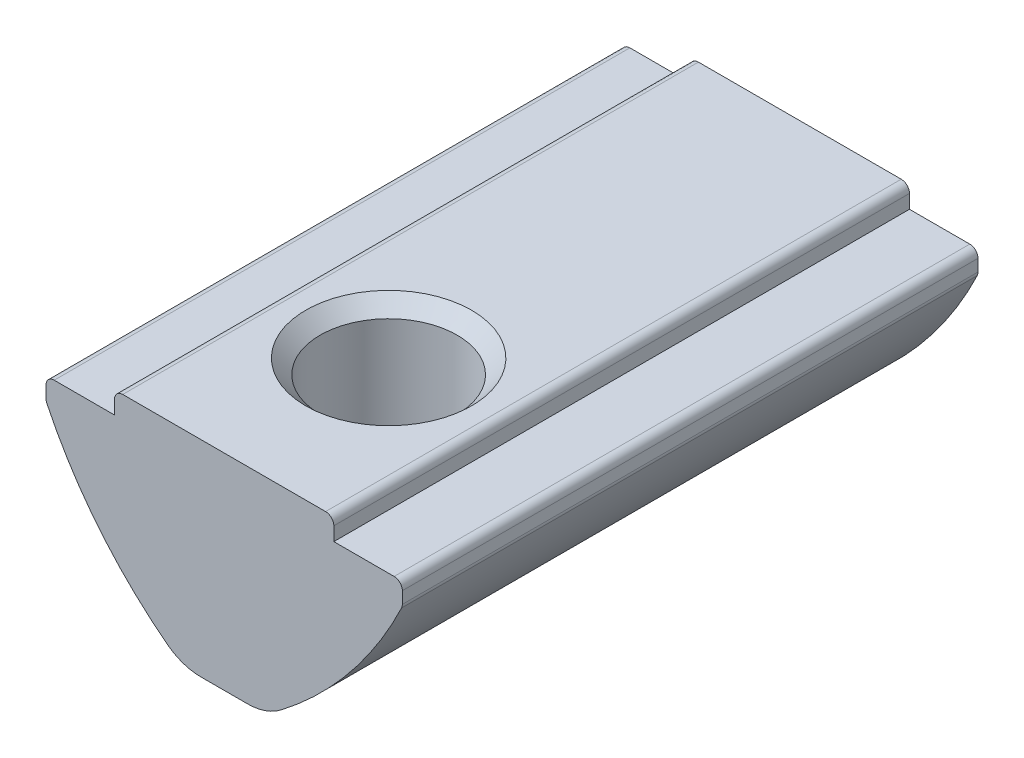
ISO-10303-21;
HEADER;
FILE_DESCRIPTION(('STEP AP214'),'2;1');
FILE_NAME('part.step','',(''),(''),'','','');
FILE_SCHEMA(('AUTOMOTIVE_DESIGN { 1 0 10303 214 1 1 1 1 }'));
ENDSEC;
DATA;
#1=APPLICATION_CONTEXT('core data for automotive mechanical design processes');
#2=APPLICATION_PROTOCOL_DEFINITION('international standard','automotive_design',2000,#1);
#3=PRODUCT_CONTEXT('',#1,'mechanical');
#4=PRODUCT('Part','Part','',(#3));
#5=PRODUCT_RELATED_PRODUCT_CATEGORY('part','',(#4));
#6=PRODUCT_DEFINITION_FORMATION('','',#4);
#7=PRODUCT_DEFINITION_CONTEXT('part definition',#1,'design');
#8=PRODUCT_DEFINITION('design','',#6,#7);
#9=PRODUCT_DEFINITION_SHAPE('','',#8);
#10=(LENGTH_UNIT() NAMED_UNIT(*) SI_UNIT(.MILLI.,.METRE.));
#11=(NAMED_UNIT(*) PLANE_ANGLE_UNIT() SI_UNIT($,.RADIAN.));
#12=(NAMED_UNIT(*) SI_UNIT($,.STERADIAN.) SOLID_ANGLE_UNIT());
#13=UNCERTAINTY_MEASURE_WITH_UNIT(LENGTH_MEASURE(1.E-05),#10,'distance_accuracy_value','');
#14=(GEOMETRIC_REPRESENTATION_CONTEXT(3) GLOBAL_UNCERTAINTY_ASSIGNED_CONTEXT((#13)) GLOBAL_UNIT_ASSIGNED_CONTEXT((#10,
#11,#12)) REPRESENTATION_CONTEXT('',''));
#15=CARTESIAN_POINT('',(0.,0.,0.));
#16=DIRECTION('',(0.,0.,1.));
#17=DIRECTION('',(1.,0.,0.));
#18=AXIS2_PLACEMENT_3D('',#15,#16,#17);
#19=CARTESIAN_POINT('',(-1.5,-7.5,10.5));
#20=DIRECTION('',(0.,1.,0.));
#21=DIRECTION('',(0.,0.,1.));
#22=AXIS2_PLACEMENT_3D('',#19,#20,#21);
#23=PLANE('',#22);
#24=DIRECTION('',(0.,0.,-1.));
#25=VECTOR('',#24,1.);
#26=CARTESIAN_POINT('',(0.84882059675723,-7.5,10.5));
#27=LINE('',#26,#25);
#28=CARTESIAN_POINT('',(0.84882059675723,-7.5,-10.5));
#29=VERTEX_POINT('',#28);
#30=CARTESIAN_POINT('',(0.84882059675723,-7.5,-7.85628300679493));
#31=VERTEX_POINT('',#30);
#32=EDGE_CURVE('E213',#29,#31,#27,.F.);
#33=ORIENTED_EDGE('',*,*,#32,.T.);
#34=CARTESIAN_POINT('',(0.,-7.5,-6.5));
#35=DIRECTION('',(0.,1.,0.));
#36=DIRECTION('',(0.,0.,1.));
#37=AXIS2_PLACEMENT_3D('',#34,#35,#36);
#38=CIRCLE('',#37,1.6);
#39=CARTESIAN_POINT('',(-0.84882059675723,-7.5,-7.85628300679494));
#40=VERTEX_POINT('',#39);
#41=EDGE_CURVE('E58',#31,#40,#38,.T.);
#42=ORIENTED_EDGE('',*,*,#41,.T.);
#43=DIRECTION('',(0.,0.,-1.));
#44=VECTOR('',#43,1.);
#45=CARTESIAN_POINT('',(-0.84882059675723,-7.5,10.5));
#46=LINE('',#45,#44);
#47=CARTESIAN_POINT('',(-0.84882059675723,-7.5,-10.5));
#48=VERTEX_POINT('',#47);
#49=EDGE_CURVE('E379',#40,#48,#46,.T.);
#50=ORIENTED_EDGE('',*,*,#49,.T.);
#51=DIRECTION('',(1.,0.,0.));
#52=VECTOR('',#51,1.);
#53=CARTESIAN_POINT('',(-1.5,-7.5,-10.5));
#54=LINE('',#53,#52);
#55=EDGE_CURVE('E466',#48,#29,#54,.T.);
#56=ORIENTED_EDGE('',*,*,#55,.T.);
#57=EDGE_LOOP('',(#33,#42,#50,#56));
#58=FACE_BOUND('',#57,.T.);
#59=ADVANCED_FACE('F37',(#58),#23,.F.);
#60=CARTESIAN_POINT('',(-0.84882059675723,-7.5,2.14851034564881));
#61=VERTEX_POINT('',#60);
#62=CARTESIAN_POINT('',(-0.84882059675723,-7.5,-5.14371699320506));
#63=VERTEX_POINT('',#62);
#64=EDGE_CURVE('E219',#61,#63,#46,.T.);
#65=ORIENTED_EDGE('',*,*,#64,.T.);
#66=CARTESIAN_POINT('',(0.84882059675723,-7.5,-5.14371699320507));
#67=VERTEX_POINT('',#66);
#68=EDGE_CURVE('E217',#63,#67,#38,.T.);
#69=ORIENTED_EDGE('',*,*,#68,.T.);
#70=CARTESIAN_POINT('',(0.84882059675723,-7.5,2.14851034564881));
#71=VERTEX_POINT('',#70);
#72=EDGE_CURVE('E205',#67,#71,#27,.F.);
#73=ORIENTED_EDGE('',*,*,#72,.T.);
#74=CARTESIAN_POINT('',(0.,-7.5,4.5));
#75=DIRECTION('',(0.,1.,0.));
#76=DIRECTION('',(0.,0.,1.));
#77=AXIS2_PLACEMENT_3D('',#74,#75,#76);
#78=CIRCLE('',#77,2.5);
#79=EDGE_CURVE('E546',#71,#61,#78,.T.);
#80=ORIENTED_EDGE('',*,*,#79,.T.);
#81=EDGE_LOOP('',(#65,#69,#73,#80));
#82=FACE_BOUND('',#81,.T.);
#83=ADVANCED_FACE('F218',(#82),#23,.F.);
#84=CARTESIAN_POINT('',(-0.84882059675723,-5.5,10.5));
#85=DIRECTION('',(0.,0.,-1.));
#86=DIRECTION('',(-1.,0.,0.));
#87=AXIS2_PLACEMENT_3D('',#84,#85,#86);
#88=CYLINDRICAL_SURFACE('',#87,2.);
#89=CARTESIAN_POINT('',(-0.84862059675723,-7.49999999,-5.14359183622355));
#90=CARTESIAN_POINT('',(-0.893920417374782,-7.50001597939785,-5.1719407315319));
#91=CARTESIAN_POINT('',(-0.938411665543847,-7.49847031841211,-5.20157310121503));
#92=CARTESIAN_POINT('',(-1.02536727830624,-7.49266619763591,-5.26346370014139));
#93=CARTESIAN_POINT('',(-1.06783093828147,-7.48840680205097,-5.29572283183958));
#94=CARTESIAN_POINT('',(-1.15058196715608,-7.47754793031724,-5.3631444221097));
#95=CARTESIAN_POINT('',(-1.19085178101182,-7.47093208484472,-5.39832583536386));
#96=CARTESIAN_POINT('',(-1.26841717204776,-7.45588891376005,-5.47143937434215));
#97=CARTESIAN_POINT('',(-1.30571349778757,-7.44746204604972,-5.50937080314435));
#98=CARTESIAN_POINT('',(-1.400673100004,-7.42332855740688,-5.61439144722884));
#99=CARTESIAN_POINT('',(-1.45530041175115,-7.40651913912559,-5.68403319287582));
#100=CARTESIAN_POINT('',(-1.55227512789681,-7.37290832688576,-5.83118215233379));
#101=CARTESIAN_POINT('',(-1.5946663503423,-7.35610712492865,-5.90865992374011));
#102=CARTESIAN_POINT('',(-1.65589549983114,-7.33015326755531,-6.05122785378434));
#103=CARTESIAN_POINT('',(-1.67795236402968,-7.32013387735501,-6.11476472107596));
#104=CARTESIAN_POINT('',(-1.71204388562128,-7.30421907875782,-6.24498489694868));
#105=CARTESIAN_POINT('',(-1.72408787769395,-7.29831983010756,-6.31166521355792));
#106=CARTESIAN_POINT('',(-1.73724099236442,-7.29186203768552,-6.44671795857442));
#107=CARTESIAN_POINT('',(-1.73829597266998,-7.29132993798517,-6.51509710287791));
#108=CARTESIAN_POINT('',(-1.72923200837907,-7.29579993929629,-6.65092865556945));
#109=CARTESIAN_POINT('',(-1.71910897628651,-7.3008040647565,-6.71838071581356));
#110=CARTESIAN_POINT('',(-1.68954026321085,-7.31478083529031,-6.84601911935351));
#111=CARTESIAN_POINT('',(-1.67074609314059,-7.32347318191401,-6.90639235362659));
#112=CARTESIAN_POINT('',(-1.62523242319014,-7.34331257713247,-7.02361961096726));
#113=CARTESIAN_POINT('',(-1.59850827832768,-7.35446106342243,-7.08047154777786));
#114=CARTESIAN_POINT('',(-1.52205364552012,-7.38393190387619,-7.21973230748937));
#115=CARTESIAN_POINT('',(-1.46767727087186,-7.40288997520654,-7.29945773798883));
#116=CARTESIAN_POINT('',(-1.34636969879211,-7.43815652252946,-7.44949920798115));
#117=CARTESIAN_POINT('',(-1.27940762800804,-7.45445829488339,-7.51979136451));
#118=CARTESIAN_POINT('',(-1.15252276724061,-7.47760241382482,-7.63606572297524));
#119=CARTESIAN_POINT('',(-1.09453123398406,-7.48575872197645,-7.6839180532923));
#120=CARTESIAN_POINT('',(-0.974420444333699,-7.49697001250135,-7.77413863930349));
#121=CARTESIAN_POINT('',(-0.912322946277687,-7.50004994530099,-7.81653276756944));
#122=CARTESIAN_POINT('',(-0.84862059675723,-7.49999999,-7.85640816377645));
#123=B_SPLINE_CURVE_WITH_KNOTS('',3,(#89,#90,#91,#92,#93,#94,#95,#96,#97,#98,#99,#100,#101,#102,
#103,#104,#105,#106,#107,#108,#109,#110,#111,#112,#113,#114,#115,#116,#117,#118,#119,#120,#121,
#122),.UNSPECIFIED.,.F.,.F.,(4,2,2,2,2,2,2,2,2,2,2,2,2,2,2,2,4),(0.,0.160266074880731,
0.320587445272625,0.482044950159162,0.643461679794423,0.912696961225031,1.18095578400885,
1.38415001995781,1.5871546113343,1.79115892549288,1.9952378632099,2.18599856740733,
2.37687123099049,2.6703129257304,2.96448407161075,3.19089694141928,3.41619363507759),.UNSPECIFIED.);
#124=EDGE_CURVE('E65',#63,#40,#123,.T.);
#125=ORIENTED_EDGE('',*,*,#124,.F.);
#126=ORIENTED_EDGE('',*,*,#64,.F.);
#127=CARTESIAN_POINT('',(-2.06504804382504,-7.08769984474361,3.09089511508392));
#128=CARTESIAN_POINT('',(-2.02884946522557,-7.11542396513753,3.03787642415071));
#129=CARTESIAN_POINT('',(-1.99056534005318,-7.14278910774625,2.98613210814124));
#130=CARTESIAN_POINT('',(-1.90965497926506,-7.19616959676198,2.88524494045446));
#131=CARTESIAN_POINT('',(-1.86702113813583,-7.22218245456567,2.83610688191055));
#132=CARTESIAN_POINT('',(-1.73158943556605,-7.29762396950776,2.69194448207737));
#133=CARTESIAN_POINT('',(-1.63202667619464,-7.34383579937291,2.60130750250006));
#134=CARTESIAN_POINT('',(-1.44219420001787,-7.41193179500749,2.45531238867026));
#135=CARTESIAN_POINT('',(-1.35553024778449,-7.43699809104728,2.39673013891566));
#136=CARTESIAN_POINT('',(-1.1739706867223,-7.4755471624909,2.29030958967992));
#137=CARTESIAN_POINT('',(-1.07913277437417,-7.48910480787486,2.24240336565446));
#138=CARTESIAN_POINT('',(-0.959553137540056,-7.49705293606094,2.19135820105156));
#139=CARTESIAN_POINT('',(-0.937603755563969,-7.49815114370639,2.18235772006265));
#140=CARTESIAN_POINT('',(-0.893417383983215,-7.4996244611753,2.16496975964218));
#141=CARTESIAN_POINT('',(-0.871180159123296,-7.49999893627301,2.1565828244964));
#142=CARTESIAN_POINT('',(-0.84882059675723,-7.5,2.14851034564881));
#143=B_SPLINE_CURVE_WITH_KNOTS('',3,(#127,#128,#129,#130,#131,#132,#133,#134,#135,#136,#137,
#138,#139,#140,#141,#142),.UNSPECIFIED.,.F.,.F.,(4,2,2,2,2,2,2,4),(0.,0.209670282949377,
0.419713672135732,0.844264308316925,1.16581336286073,1.48525417619118,1.55648665653799,
1.62778158068269),.UNSPECIFIED.);
#144=CARTESIAN_POINT('',(-2.06504804382504,-7.08769984474362,3.09089511508392));
#145=VERTEX_POINT('',#144);
#146=EDGE_CURVE('E285',#145,#61,#143,.T.);
#147=ORIENTED_EDGE('',*,*,#146,.F.);
#148=DIRECTION('',(0.,0.,-1.));
#149=VECTOR('',#148,1.);
#150=CARTESIAN_POINT('',(-2.06504804382504,-7.08769984474362,10.5));
#151=LINE('',#150,#149);
#152=CARTESIAN_POINT('',(-2.06504804382504,-7.08769984474362,-10.5));
#153=VERTEX_POINT('',#152);
#154=EDGE_CURVE('E543',#153,#145,#151,.F.);
#155=ORIENTED_EDGE('',*,*,#154,.F.);
#156=CARTESIAN_POINT('',(-0.84882059675723,-5.5,-10.5));
#157=DIRECTION('',(0.,0.,1.));
#158=DIRECTION('',(1.,0.,0.));
#159=AXIS2_PLACEMENT_3D('',#156,#157,#158);
#160=CIRCLE('',#159,2.);
#161=EDGE_CURVE('E384',#48,#153,#160,.F.);
#162=ORIENTED_EDGE('',*,*,#161,.F.);
#163=ORIENTED_EDGE('',*,*,#49,.F.);
#164=EDGE_LOOP('',(#125,#126,#147,#155,#162,#163));
#165=FACE_BOUND('',#164,.T.);
#166=ADVANCED_FACE('F352',(#165),#88,.T.);
#167=CARTESIAN_POINT('',(0.84882059675723,-5.5,10.5));
#168=DIRECTION('',(0.,0.,-1.));
#169=DIRECTION('',(-1.,0.,0.));
#170=AXIS2_PLACEMENT_3D('',#167,#168,#169);
#171=CYLINDRICAL_SURFACE('',#170,2.);
#172=CARTESIAN_POINT('',(0.84862059675723,-7.49999999,-7.85640816377645));
#173=CARTESIAN_POINT('',(0.893920417374782,-7.50001597939785,-7.8280592684681));
#174=CARTESIAN_POINT('',(0.938411665543847,-7.49847031841211,-7.79842689878497));
#175=CARTESIAN_POINT('',(1.02536727830624,-7.49266619763591,-7.73653629985861));
#176=CARTESIAN_POINT('',(1.06783093828147,-7.48840680205097,-7.70427716816043));
#177=CARTESIAN_POINT('',(1.15058196715608,-7.47754793031724,-7.6368555778903));
#178=CARTESIAN_POINT('',(1.19085178101182,-7.47093208484472,-7.60167416463615));
#179=CARTESIAN_POINT('',(1.26841717204776,-7.45588891376005,-7.52856062565786));
#180=CARTESIAN_POINT('',(1.30571349778757,-7.44746204604972,-7.49062919685565));
#181=CARTESIAN_POINT('',(1.40067310000399,-7.42332855740688,-7.38560855277116));
#182=CARTESIAN_POINT('',(1.45530041175114,-7.40651913912559,-7.31596680712418));
#183=CARTESIAN_POINT('',(1.5522751278968,-7.37290832688577,-7.16881784766621));
#184=CARTESIAN_POINT('',(1.5946663503423,-7.35610712492865,-7.09134007625989));
#185=CARTESIAN_POINT('',(1.65589549983113,-7.33015326755531,-6.94877214621567));
#186=CARTESIAN_POINT('',(1.67795236402968,-7.32013387735502,-6.88523527892405));
#187=CARTESIAN_POINT('',(1.71204388562128,-7.30421907875782,-6.75501510305133));
#188=CARTESIAN_POINT('',(1.72408787769395,-7.29831983010756,-6.68833478644209));
#189=CARTESIAN_POINT('',(1.73724099236442,-7.29186203768552,-6.55328204142559));
#190=CARTESIAN_POINT('',(1.73829597266998,-7.29132993798517,-6.4849028971221));
#191=CARTESIAN_POINT('',(1.72923200837907,-7.29579993929629,-6.34907134443056));
#192=CARTESIAN_POINT('',(1.71910897628651,-7.3008040647565,-6.28161928418645));
#193=CARTESIAN_POINT('',(1.68954026321085,-7.31478083529031,-6.1539808806465));
#194=CARTESIAN_POINT('',(1.67074609314059,-7.32347318191401,-6.09360764637342));
#195=CARTESIAN_POINT('',(1.62523242319015,-7.34331257713247,-5.97638038903274));
#196=CARTESIAN_POINT('',(1.59850827832768,-7.35446106342243,-5.91952845222215));
#197=CARTESIAN_POINT('',(1.52205364552012,-7.38393190387619,-5.78026769251063));
#198=CARTESIAN_POINT('',(1.46767727087186,-7.40288997520653,-5.70054226201118));
#199=CARTESIAN_POINT('',(1.34636969879211,-7.43815652252946,-5.55050079201886));
#200=CARTESIAN_POINT('',(1.27940762800804,-7.45445829488339,-5.48020863549001));
#201=CARTESIAN_POINT('',(1.15252276724061,-7.47760241382482,-5.36393427702477));
#202=CARTESIAN_POINT('',(1.09453123398406,-7.48575872197645,-5.3160819467077));
#203=CARTESIAN_POINT('',(0.9744204443337,-7.49697001250135,-5.22586136069651));
#204=CARTESIAN_POINT('',(0.912322946277686,-7.50004994530099,-5.18346723243056));
#205=CARTESIAN_POINT('',(0.848620596757229,-7.49999999,-5.14359183622355));
#206=B_SPLINE_CURVE_WITH_KNOTS('',3,(#172,#173,#174,#175,#176,#177,#178,#179,#180,#181,#182,
#183,#184,#185,#186,#187,#188,#189,#190,#191,#192,#193,#194,#195,#196,#197,#198,#199,#200,#201,
#202,#203,#204,#205),.UNSPECIFIED.,.F.,.F.,(4,2,2,2,2,2,2,2,2,2,2,2,2,2,2,2,4),(0.,
0.160266074880731,0.320587445272624,0.48204495015916,0.64346167979442,0.912696961225026,
1.18095578400885,1.3841500199578,1.5871546113343,1.79115892549288,1.99523786320989,
2.18599856740732,2.37687123099049,2.67031292573039,2.96448407161075,3.19089694141928,
3.41619363507759),.UNSPECIFIED.);
#207=EDGE_CURVE('E11',#31,#67,#206,.T.);
#208=ORIENTED_EDGE('',*,*,#207,.F.);
#209=ORIENTED_EDGE('',*,*,#32,.F.);
#210=CARTESIAN_POINT('',(0.84882059675723,-5.5,-10.5));
#211=DIRECTION('',(0.,0.,1.));
#212=DIRECTION('',(1.,0.,0.));
#213=AXIS2_PLACEMENT_3D('',#210,#211,#212);
#214=CIRCLE('',#213,2.);
#215=CARTESIAN_POINT('',(2.06504804382504,-7.08769984474362,-10.5));
#216=VERTEX_POINT('',#215);
#217=EDGE_CURVE('E381',#216,#29,#214,.F.);
#218=ORIENTED_EDGE('',*,*,#217,.F.);
#219=DIRECTION('',(0.,0.,-1.));
#220=VECTOR('',#219,1.);
#221=CARTESIAN_POINT('',(2.06504804382504,-7.08769984474362,10.5));
#222=LINE('',#221,#220);
#223=CARTESIAN_POINT('',(2.06504804382505,-7.08769984474361,3.09089511508393));
#224=VERTEX_POINT('',#223);
#225=EDGE_CURVE('E394',#224,#216,#222,.T.);
#226=ORIENTED_EDGE('',*,*,#225,.F.);
#227=CARTESIAN_POINT('',(0.84882059675723,-7.5,2.14851034564881));
#228=CARTESIAN_POINT('',(0.901968749623979,-7.50000933579773,2.1676809833156));
#229=CARTESIAN_POINT('',(0.954425967779777,-7.4978823066011,2.18866656499897));
#230=CARTESIAN_POINT('',(1.05747733761987,-7.4897535051503,2.23397118641904));
#231=CARTESIAN_POINT('',(1.10807429047199,-7.48375783395438,2.25828492997892));
#232=CARTESIAN_POINT('',(1.20669680410747,-7.46834929917004,2.30980409397805));
#233=CARTESIAN_POINT('',(1.25473972584813,-7.4589642127543,2.33698477270637));
#234=CARTESIAN_POINT('',(1.34844165831506,-7.43718734557834,2.3941223163964));
#235=CARTESIAN_POINT('',(1.39409956518012,-7.42479418731004,2.42408044936213));
#236=CARTESIAN_POINT('',(1.54613352594975,-7.37788076511081,2.53104829646633));
#237=CARTESIAN_POINT('',(1.64629156659955,-7.33700041986086,2.61425771112131));
#238=CARTESIAN_POINT('',(1.83044133091475,-7.24557307141553,2.79236940285875));
#239=CARTESIAN_POINT('',(1.91440465564104,-7.19500939143518,2.88729175033324));
#240=CARTESIAN_POINT('',(2.01612819581955,-7.1243114839043,3.02113718611081));
#241=CARTESIAN_POINT('',(2.04105877542152,-7.10607804912092,3.05575043924063));
#242=CARTESIAN_POINT('',(2.06504804382507,-7.08769984474363,3.09089511508391));
#243=B_SPLINE_CURVE_WITH_KNOTS('',3,(#227,#228,#229,#230,#231,#232,#233,#234,#235,#236,#237,
#238,#239,#240,#241,#242),.UNSPECIFIED.,.F.,.F.,(4,2,2,2,2,2,2,4),(0.,0.169376289008547,
0.338486113137806,0.506240367401263,0.674071588001856,1.08112825973564,1.48889237965736,
1.62799674644004),.UNSPECIFIED.);
#244=EDGE_CURVE('E51',#71,#224,#243,.T.);
#245=ORIENTED_EDGE('',*,*,#244,.F.);
#246=ORIENTED_EDGE('',*,*,#72,.F.);
#247=EDGE_LOOP('',(#208,#209,#218,#226,#245,#246));
#248=FACE_BOUND('',#247,.T.);
#249=ADVANCED_FACE('F207',(#248),#171,.T.);
#250=CARTESIAN_POINT('',(4.,0.,10.5));
#251=DIRECTION('',(-1.,0.,0.));
#252=DIRECTION('',(0.,0.,1.));
#253=AXIS2_PLACEMENT_3D('',#250,#251,#252);
#254=PLANE('',#253);
#255=DIRECTION('',(0.,1.,0.));
#256=VECTOR('',#255,1.);
#257=CARTESIAN_POINT('',(4.,0.,-10.5));
#258=LINE('',#257,#256);
#259=CARTESIAN_POINT('',(4.,-0.799999999999998,-10.5));
#260=VERTEX_POINT('',#259);
#261=CARTESIAN_POINT('',(4.,-0.3,-10.5));
#262=VERTEX_POINT('',#261);
#263=EDGE_CURVE('E482',#260,#262,#258,.T.);
#264=ORIENTED_EDGE('',*,*,#263,.T.);
#265=DIRECTION('',(0.,0.,-1.));
#266=VECTOR('',#265,1.);
#267=CARTESIAN_POINT('',(4.,-0.3,10.5));
#268=LINE('',#267,#266);
#269=CARTESIAN_POINT('',(4.,-0.3,10.5));
#270=VERTEX_POINT('',#269);
#271=EDGE_CURVE('E431',#262,#270,#268,.F.);
#272=ORIENTED_EDGE('',*,*,#271,.T.);
#273=DIRECTION('',(0.,1.,0.));
#274=VECTOR('',#273,1.);
#275=CARTESIAN_POINT('',(4.,0.,10.5));
#276=LINE('',#275,#274);
#277=CARTESIAN_POINT('',(4.,-0.799999999999998,10.5));
#278=VERTEX_POINT('',#277);
#279=EDGE_CURVE('E460',#278,#270,#276,.T.);
#280=ORIENTED_EDGE('',*,*,#279,.F.);
#281=DIRECTION('',(0.,0.,-1.));
#282=VECTOR('',#281,1.);
#283=CARTESIAN_POINT('',(4.,-0.799999999999998,10.5));
#284=LINE('',#283,#282);
#285=EDGE_CURVE('E454',#278,#260,#284,.T.);
#286=ORIENTED_EDGE('',*,*,#285,.T.);
#287=EDGE_LOOP('',(#264,#272,#280,#286));
#288=FACE_BOUND('',#287,.T.);
#289=ADVANCED_FACE('F313',(#288),#254,.F.);
#290=CARTESIAN_POINT('',(-4.,0.,10.5));
#291=DIRECTION('',(0.,-1.,0.));
#292=DIRECTION('',(0.,0.,-1.));
#293=AXIS2_PLACEMENT_3D('',#290,#291,#292);
#294=PLANE('',#293);
#295=CARTESIAN_POINT('',(0.,0.,4.5));
#296=DIRECTION('',(0.,1.,0.));
#297=DIRECTION('',(0.,0.,1.));
#298=AXIS2_PLACEMENT_3D('',#295,#296,#297);
#299=CIRCLE('',#298,3.025);
#300=CARTESIAN_POINT('',(0.,0.,7.525));
#301=VERTEX_POINT('',#300);
#302=EDGE_CURVE('E223',#301,#301,#299,.T.);
#303=ORIENTED_EDGE('',*,*,#302,.F.);
#304=EDGE_LOOP('',(#303));
#305=FACE_BOUND('',#304,.T.);
#306=DIRECTION('',(-1.,0.,0.));
#307=VECTOR('',#306,1.);
#308=CARTESIAN_POINT('',(-4.,0.,10.5));
#309=LINE('',#308,#307);
#310=CARTESIAN_POINT('',(3.7,0.,10.5));
#311=VERTEX_POINT('',#310);
#312=CARTESIAN_POINT('',(-3.7,0.,10.5));
#313=VERTEX_POINT('',#312);
#314=EDGE_CURVE('E503',#311,#313,#309,.T.);
#315=ORIENTED_EDGE('',*,*,#314,.F.);
#316=DIRECTION('',(0.,0.,-1.));
#317=VECTOR('',#316,1.);
#318=CARTESIAN_POINT('',(3.7,0.,10.5));
#319=LINE('',#318,#317);
#320=CARTESIAN_POINT('',(3.7,0.,-10.5));
#321=VERTEX_POINT('',#320);
#322=EDGE_CURVE('E446',#311,#321,#319,.T.);
#323=ORIENTED_EDGE('',*,*,#322,.T.);
#324=DIRECTION('',(-1.,0.,0.));
#325=VECTOR('',#324,1.);
#326=CARTESIAN_POINT('',(-4.,0.,-10.5));
#327=LINE('',#326,#325);
#328=CARTESIAN_POINT('',(-3.7,0.,-10.5));
#329=VERTEX_POINT('',#328);
#330=EDGE_CURVE('E479',#321,#329,#327,.T.);
#331=ORIENTED_EDGE('',*,*,#330,.T.);
#332=DIRECTION('',(0.,0.,-1.));
#333=VECTOR('',#332,1.);
#334=CARTESIAN_POINT('',(-3.7,0.,10.5));
#335=LINE('',#334,#333);
#336=EDGE_CURVE('E449',#329,#313,#335,.F.);
#337=ORIENTED_EDGE('',*,*,#336,.T.);
#338=EDGE_LOOP('',(#315,#323,#331,#337));
#339=FACE_BOUND('',#338,.T.);
#340=ADVANCED_FACE('F309',(#305,#339),#294,.F.);
#341=CARTESIAN_POINT('',(-4.,0.,10.5));
#342=DIRECTION('',(1.,0.,0.));
#343=DIRECTION('',(0.,0.,-1.));
#344=AXIS2_PLACEMENT_3D('',#341,#342,#343);
#345=PLANE('',#344);
#346=DIRECTION('',(0.,-1.,0.));
#347=VECTOR('',#346,1.);
#348=CARTESIAN_POINT('',(-4.,0.,10.5));
#349=LINE('',#348,#347);
#350=CARTESIAN_POINT('',(-4.,-0.3,10.5));
#351=VERTEX_POINT('',#350);
#352=CARTESIAN_POINT('',(-4.,-0.8,10.5));
#353=VERTEX_POINT('',#352);
#354=EDGE_CURVE('E501',#351,#353,#349,.T.);
#355=ORIENTED_EDGE('',*,*,#354,.F.);
#356=DIRECTION('',(0.,0.,-1.));
#357=VECTOR('',#356,1.);
#358=CARTESIAN_POINT('',(-4.,-0.3,10.5));
#359=LINE('',#358,#357);
#360=CARTESIAN_POINT('',(-4.,-0.3,-10.5));
#361=VERTEX_POINT('',#360);
#362=EDGE_CURVE('E416',#351,#361,#359,.T.);
#363=ORIENTED_EDGE('',*,*,#362,.T.);
#364=DIRECTION('',(0.,-1.,0.));
#365=VECTOR('',#364,1.);
#366=CARTESIAN_POINT('',(-4.,0.,-10.5));
#367=LINE('',#366,#365);
#368=CARTESIAN_POINT('',(-4.,-0.8,-10.5));
#369=VERTEX_POINT('',#368);
#370=EDGE_CURVE('E477',#361,#369,#367,.T.);
#371=ORIENTED_EDGE('',*,*,#370,.T.);
#372=DIRECTION('',(0.,0.,-1.));
#373=VECTOR('',#372,1.);
#374=CARTESIAN_POINT('',(-4.,-0.8,10.5));
#375=LINE('',#374,#373);
#376=EDGE_CURVE('E451',#353,#369,#375,.T.);
#377=ORIENTED_EDGE('',*,*,#376,.F.);
#378=EDGE_LOOP('',(#355,#363,#371,#377));
#379=FACE_BOUND('',#378,.T.);
#380=ADVANCED_FACE('F305',(#379),#345,.F.);
#381=CARTESIAN_POINT('',(-4.,-0.8,10.5));
#382=DIRECTION('',(0.,-1.,0.));
#383=DIRECTION('',(1.,0.,0.));
#384=AXIS2_PLACEMENT_3D('',#381,#382,#383);
#385=PLANE('',#384);
#386=DIRECTION('',(-1.,0.,0.));
#387=VECTOR('',#386,1.);
#388=CARTESIAN_POINT('',(-4.,-0.8,-10.5));
#389=LINE('',#388,#387);
#390=CARTESIAN_POINT('',(-6.2,-0.8,-10.5));
#391=VERTEX_POINT('',#390);
#392=EDGE_CURVE('E474',#369,#391,#389,.T.);
#393=ORIENTED_EDGE('',*,*,#392,.T.);
#394=DIRECTION('',(0.,0.,-1.));
#395=VECTOR('',#394,1.);
#396=CARTESIAN_POINT('',(-6.2,-0.8,10.5));
#397=LINE('',#396,#395);
#398=CARTESIAN_POINT('',(-6.2,-0.8,10.5));
#399=VERTEX_POINT('',#398);
#400=EDGE_CURVE('E398',#391,#399,#397,.F.);
#401=ORIENTED_EDGE('',*,*,#400,.T.);
#402=DIRECTION('',(-1.,0.,0.));
#403=VECTOR('',#402,1.);
#404=CARTESIAN_POINT('',(-4.,-0.8,10.5));
#405=LINE('',#404,#403);
#406=EDGE_CURVE('E498',#353,#399,#405,.T.);
#407=ORIENTED_EDGE('',*,*,#406,.F.);
#408=ORIENTED_EDGE('',*,*,#376,.T.);
#409=EDGE_LOOP('',(#393,#401,#407,#408));
#410=FACE_BOUND('',#409,.T.);
#411=ADVANCED_FACE('F301',(#410),#385,.F.);
#412=CARTESIAN_POINT('',(-6.5,-0.8,10.5));
#413=DIRECTION('',(1.,0.,0.));
#414=DIRECTION('',(0.,1.,0.));
#415=AXIS2_PLACEMENT_3D('',#412,#413,#414);
#416=PLANE('',#415);
#417=DIRECTION('',(0.,-1.,0.));
#418=VECTOR('',#417,1.);
#419=CARTESIAN_POINT('',(-6.5,-0.8,10.5));
#420=LINE('',#419,#418);
#421=CARTESIAN_POINT('',(-6.5,-1.1,10.5));
#422=VERTEX_POINT('',#421);
#423=CARTESIAN_POINT('',(-6.5,-1.53219657512287,10.5));
#424=VERTEX_POINT('',#423);
#425=EDGE_CURVE('E495',#422,#424,#420,.T.);
#426=ORIENTED_EDGE('',*,*,#425,.F.);
#427=DIRECTION('',(0.,0.,-1.));
#428=VECTOR('',#427,1.);
#429=CARTESIAN_POINT('',(-6.5,-1.1,10.5));
#430=LINE('',#429,#428);
#431=CARTESIAN_POINT('',(-6.5,-1.1,-10.5));
#432=VERTEX_POINT('',#431);
#433=EDGE_CURVE('E400',#422,#432,#430,.T.);
#434=ORIENTED_EDGE('',*,*,#433,.T.);
#435=DIRECTION('',(0.,-1.,0.));
#436=VECTOR('',#435,1.);
#437=CARTESIAN_POINT('',(-6.5,-0.8,-10.5));
#438=LINE('',#437,#436);
#439=CARTESIAN_POINT('',(-6.5,-1.53219657512287,-10.5));
#440=VERTEX_POINT('',#439);
#441=EDGE_CURVE('E471',#432,#440,#438,.T.);
#442=ORIENTED_EDGE('',*,*,#441,.T.);
#443=DIRECTION('',(0.,0.,-1.));
#444=VECTOR('',#443,1.);
#445=CARTESIAN_POINT('',(-6.5,-1.53219657512287,10.5));
#446=LINE('',#445,#444);
#447=EDGE_CURVE('E403',#440,#424,#446,.F.);
#448=ORIENTED_EDGE('',*,*,#447,.T.);
#449=EDGE_LOOP('',(#426,#434,#442,#448));
#450=FACE_BOUND('',#449,.T.);
#451=ADVANCED_FACE('F297',(#450),#416,.F.);
#452=CARTESIAN_POINT('',(7.05665780918356,4.82004899083352,10.5));
#453=DIRECTION('',(0.,0.,-1.));
#454=DIRECTION('',(-1.,0.,0.));
#455=AXIS2_PLACEMENT_3D('',#452,#453,#454);
#456=CYLINDRICAL_SURFACE('',#455,15.);
#457=ORIENTED_EDGE('',*,*,#154,.T.);
#458=CARTESIAN_POINT('',(-2.06504804382504,-7.08769984474362,3.09089511508392));
#459=CARTESIAN_POINT('',(-2.09737445981333,-7.06293749811928,3.13827661478381));
#460=CARTESIAN_POINT('',(-2.12828123600721,-7.03905227258106,3.18706865378425));
#461=CARTESIAN_POINT('',(-2.18702866118469,-6.99331817649837,3.28744119384468));
#462=CARTESIAN_POINT('',(-2.21486652599256,-6.97147115777182,3.33902416467608));
#463=CARTESIAN_POINT('',(-2.29364517288421,-6.90924472930911,3.49837148997924));
#464=CARTESIAN_POINT('',(-2.33948251711551,-6.87246463950198,3.6102012944941));
#465=CARTESIAN_POINT('',(-2.41527572331899,-6.81115469231194,3.84310078308449));
#466=CARTESIAN_POINT('',(-2.44514151637341,-6.78669435421744,3.96421855494102));
#467=CARTESIAN_POINT('',(-2.48640701720856,-6.75279241446028,4.21126368173807));
#468=CARTESIAN_POINT('',(-2.49787255082226,-6.74329727787391,4.33717223496545));
#469=CARTESIAN_POINT('',(-2.50139676601035,-6.74038258044462,4.57640134465964));
#470=CARTESIAN_POINT('',(-2.49533423040156,-6.74540671429955,4.68968151345326));
#471=CARTESIAN_POINT('',(-2.46817666759178,-6.76778211506937,4.91327750289949));
#472=CARTESIAN_POINT('',(-2.44706530264892,-6.78514677940285,5.02358996647682));
#473=CARTESIAN_POINT('',(-2.39173059218085,-6.8302378334115,5.2357985545937));
#474=CARTESIAN_POINT('',(-2.35781294712917,-6.85772229872877,5.33782819942757));
#475=CARTESIAN_POINT('',(-2.27844453052972,-6.92126400435098,5.53436746456581));
#476=CARTESIAN_POINT('',(-2.23299917771901,-6.95731721631338,5.62888059075725));
#477=CARTESIAN_POINT('',(-2.16428092016536,-7.01104706106402,5.75192225411085));
#478=CARTESIAN_POINT('',(-2.14527307167119,-7.025839950066,5.78421074532453));
#479=CARTESIAN_POINT('',(-2.10605445779357,-7.05620113833132,5.84755943024061));
#480=CARTESIAN_POINT('',(-2.08584643337487,-7.07176765842885,5.87862217207367));
#481=CARTESIAN_POINT('',(-2.06504804382525,-7.08769984474351,5.90910488491625));
#482=B_SPLINE_CURVE_WITH_KNOTS('',3,(#458,#459,#460,#461,#462,#463,#464,#465,#466,#467,#468,
#469,#470,#471,#472,#473,#474,#475,#476,#477,#478,#479,#480,#481),.UNSPECIFIED.,.F.,.F.,(4,2,2,
2,2,2,2,2,2,2,2,4),(0.,0.187352740943834,0.374874076953904,0.752018020771248,1.1312669577879,
1.50915610536268,1.8480890831049,2.18739058450256,2.5190579642195,2.85056972769057,
2.97138643388061,3.09193710389708),.UNSPECIFIED.);
#483=CARTESIAN_POINT('',(-2.06504804382504,-7.08769984474361,5.90910488491608));
#484=VERTEX_POINT('',#483);
#485=EDGE_CURVE('E278',#145,#484,#482,.T.);
#486=ORIENTED_EDGE('',*,*,#485,.T.);
#487=CARTESIAN_POINT('',(-2.06504804382504,-7.08769984474362,10.5));
#488=VERTEX_POINT('',#487);
#489=EDGE_CURVE('E538',#484,#488,#151,.F.);
#490=ORIENTED_EDGE('',*,*,#489,.T.);
#491=CARTESIAN_POINT('',(7.05665780918356,4.82004899083352,10.5));
#492=DIRECTION('',(0.,0.,1.));
#493=DIRECTION('',(1.,0.,0.));
#494=AXIS2_PLACEMENT_3D('',#491,#492,#493);
#495=CIRCLE('',#494,15.);
#496=CARTESIAN_POINT('',(-6.47054403692211,-1.66183423973423,10.5));
#497=VERTEX_POINT('',#496);
#498=EDGE_CURVE('E492',#497,#488,#495,.T.);
#499=ORIENTED_EDGE('',*,*,#498,.F.);
#500=DIRECTION('',(0.,0.,-1.));
#501=VECTOR('',#500,1.);
#502=CARTESIAN_POINT('',(-6.47054403692211,-1.66183423973423,10.5));
#503=LINE('',#502,#501);
#504=CARTESIAN_POINT('',(-6.47054403692211,-1.66183423973423,-10.5));
#505=VERTEX_POINT('',#504);
#506=EDGE_CURVE('E395',#497,#505,#503,.T.);
#507=ORIENTED_EDGE('',*,*,#506,.T.);
#508=CARTESIAN_POINT('',(7.05665780918356,4.82004899083352,-10.5));
#509=DIRECTION('',(0.,0.,1.));
#510=DIRECTION('',(1.,0.,0.));
#511=AXIS2_PLACEMENT_3D('',#508,#509,#510);
#512=CIRCLE('',#511,15.);
#513=EDGE_CURVE('E468',#505,#153,#512,.T.);
#514=ORIENTED_EDGE('',*,*,#513,.T.);
#515=EDGE_LOOP('',(#457,#486,#490,#499,#507,#514));
#516=FACE_BOUND('',#515,.T.);
#517=ADVANCED_FACE('F291',(#516),#456,.T.);
#518=CARTESIAN_POINT('',(-0.84882059675723,-7.5,10.5));
#519=VERTEX_POINT('',#518);
#520=CARTESIAN_POINT('',(-0.84882059675723,-7.5,6.85148965435119));
#521=VERTEX_POINT('',#520);
#522=EDGE_CURVE('E371',#519,#521,#46,.T.);
#523=ORIENTED_EDGE('',*,*,#522,.T.);
#524=CARTESIAN_POINT('',(0.84882059675723,-7.5,6.85148965435119));
#525=VERTEX_POINT('',#524);
#526=EDGE_CURVE('E372',#521,#525,#78,.T.);
#527=ORIENTED_EDGE('',*,*,#526,.T.);
#528=CARTESIAN_POINT('',(0.84882059675723,-7.5,10.5));
#529=VERTEX_POINT('',#528);
#530=EDGE_CURVE('E214',#525,#529,#27,.F.);
#531=ORIENTED_EDGE('',*,*,#530,.T.);
#532=DIRECTION('',(1.,0.,0.));
#533=VECTOR('',#532,1.);
#534=CARTESIAN_POINT('',(-1.5,-7.5,10.5));
#535=LINE('',#534,#533);
#536=EDGE_CURVE('E375',#519,#529,#535,.T.);
#537=ORIENTED_EDGE('',*,*,#536,.F.);
#538=EDGE_LOOP('',(#523,#527,#531,#537));
#539=FACE_BOUND('',#538,.T.);
#540=ADVANCED_FACE('F296',(#539),#23,.F.);
#541=CARTESIAN_POINT('',(-7.05665780918356,4.82004899083352,10.5));
#542=DIRECTION('',(0.,0.,-1.));
#543=DIRECTION('',(-1.,0.,0.));
#544=AXIS2_PLACEMENT_3D('',#541,#542,#543);
#545=CYLINDRICAL_SURFACE('',#544,15.);
#546=CARTESIAN_POINT('',(2.06504804382504,-7.08769984474362,10.5));
#547=VERTEX_POINT('',#546);
#548=CARTESIAN_POINT('',(2.06504804382504,-7.08769984474362,5.90910488491608));
#549=VERTEX_POINT('',#548);
#550=EDGE_CURVE('E389',#547,#549,#222,.T.);
#551=ORIENTED_EDGE('',*,*,#550,.T.);
#552=CARTESIAN_POINT('',(2.06504804382505,-7.08769984474361,5.90910488491607));
#553=CARTESIAN_POINT('',(2.09737445981334,-7.06293749811928,5.86172338521618));
#554=CARTESIAN_POINT('',(2.12828123600722,-7.03905227258105,5.81293134621575));
#555=CARTESIAN_POINT('',(2.18702866118469,-6.99331817649837,5.71255880615531));
#556=CARTESIAN_POINT('',(2.21486652599257,-6.97147115777182,5.66097583532391));
#557=CARTESIAN_POINT('',(2.29364517288422,-6.90924472930911,5.50162851002075));
#558=CARTESIAN_POINT('',(2.33948251711551,-6.87246463950198,5.38979870550589));
#559=CARTESIAN_POINT('',(2.415275723319,-6.81115469231194,5.1568992169155));
#560=CARTESIAN_POINT('',(2.44514151637341,-6.78669435421744,5.03578144505897));
#561=CARTESIAN_POINT('',(2.48640701720856,-6.75279241446028,4.78873631826193));
#562=CARTESIAN_POINT('',(2.49787255082226,-6.74329727787391,4.66282776503454));
#563=CARTESIAN_POINT('',(2.50139676601035,-6.74038258044462,4.42359865534035));
#564=CARTESIAN_POINT('',(2.49533423040156,-6.74540671429955,4.31031848654673));
#565=CARTESIAN_POINT('',(2.46817666759178,-6.76778211506938,4.0867224971005));
#566=CARTESIAN_POINT('',(2.44706530264892,-6.78514677940286,3.97641003352318));
#567=CARTESIAN_POINT('',(2.39173059218085,-6.8302378334115,3.76420144540629));
#568=CARTESIAN_POINT('',(2.35781294712916,-6.85772229872877,3.66217180057242));
#569=CARTESIAN_POINT('',(2.27844453052972,-6.92126400435098,3.46563253543418));
#570=CARTESIAN_POINT('',(2.23299917771901,-6.95731721631339,3.37111940924274));
#571=CARTESIAN_POINT('',(2.16428092016536,-7.01104706106403,3.24807774588915));
#572=CARTESIAN_POINT('',(2.14527307167119,-7.025839950066,3.21578925467547));
#573=CARTESIAN_POINT('',(2.10605445779357,-7.05620113833132,3.15244056975939));
#574=CARTESIAN_POINT('',(2.08584643337487,-7.07176765842885,3.12137782792634));
#575=CARTESIAN_POINT('',(2.06504804382526,-7.08769984474351,3.09089511508376));
#576=B_SPLINE_CURVE_WITH_KNOTS('',3,(#552,#553,#554,#555,#556,#557,#558,#559,#560,#561,#562,
#563,#564,#565,#566,#567,#568,#569,#570,#571,#572,#573,#574,#575),.UNSPECIFIED.,.F.,.F.,(4,2,2,
2,2,2,2,2,2,2,2,4),(0.,0.187352740943833,0.374874076953902,0.752018020771246,1.13126695778789,
1.50915610536268,1.8480890831049,2.18739058450255,2.5190579642195,2.85056972769057,
2.9713864338806,3.09193710389706),.UNSPECIFIED.);
#577=EDGE_CURVE('E264',#549,#224,#576,.T.);
#578=ORIENTED_EDGE('',*,*,#577,.T.);
#579=ORIENTED_EDGE('',*,*,#225,.T.);
#580=CARTESIAN_POINT('',(-7.05665780918356,4.82004899083352,-10.5));
#581=DIRECTION('',(0.,0.,1.));
#582=DIRECTION('',(1.,0.,0.));
#583=AXIS2_PLACEMENT_3D('',#580,#581,#582);
#584=CIRCLE('',#583,15.);
#585=CARTESIAN_POINT('',(6.47054403692211,-1.66183423973423,-10.5));
#586=VERTEX_POINT('',#585);
#587=EDGE_CURVE('E464',#216,#586,#584,.T.);
#588=ORIENTED_EDGE('',*,*,#587,.T.);
#589=DIRECTION('',(0.,0.,-1.));
#590=VECTOR('',#589,1.);
#591=CARTESIAN_POINT('',(6.47054403692211,-1.66183423973423,10.5));
#592=LINE('',#591,#590);
#593=CARTESIAN_POINT('',(6.47054403692211,-1.66183423973423,10.5));
#594=VERTEX_POINT('',#593);
#595=EDGE_CURVE('E408',#586,#594,#592,.F.);
#596=ORIENTED_EDGE('',*,*,#595,.T.);
#597=CARTESIAN_POINT('',(-7.05665780918356,4.82004899083352,10.5));
#598=DIRECTION('',(0.,0.,1.));
#599=DIRECTION('',(1.,0.,0.));
#600=AXIS2_PLACEMENT_3D('',#597,#598,#599);
#601=CIRCLE('',#600,15.);
#602=EDGE_CURVE('E489',#547,#594,#601,.T.);
#603=ORIENTED_EDGE('',*,*,#602,.F.);
#604=EDGE_LOOP('',(#551,#578,#579,#588,#596,#603));
#605=FACE_BOUND('',#604,.T.);
#606=ADVANCED_FACE('F360',(#605),#545,.T.);
#607=CARTESIAN_POINT('',(6.5,-0.8,10.5));
#608=DIRECTION('',(-1.,0.,0.));
#609=DIRECTION('',(0.,-1.,0.));
#610=AXIS2_PLACEMENT_3D('',#607,#608,#609);
#611=PLANE('',#610);
#612=DIRECTION('',(0.,1.,0.));
#613=VECTOR('',#612,1.);
#614=CARTESIAN_POINT('',(6.5,-0.8,10.5));
#615=LINE('',#614,#613);
#616=CARTESIAN_POINT('',(6.5,-1.53219657512287,10.5));
#617=VERTEX_POINT('',#616);
#618=CARTESIAN_POINT('',(6.5,-1.1,10.5));
#619=VERTEX_POINT('',#618);
#620=EDGE_CURVE('E486',#617,#619,#615,.T.);
#621=ORIENTED_EDGE('',*,*,#620,.F.);
#622=DIRECTION('',(0.,0.,-1.));
#623=VECTOR('',#622,1.);
#624=CARTESIAN_POINT('',(6.5,-1.53219657512287,10.5));
#625=LINE('',#624,#623);
#626=CARTESIAN_POINT('',(6.5,-1.53219657512287,-10.5));
#627=VERTEX_POINT('',#626);
#628=EDGE_CURVE('E411',#617,#627,#625,.T.);
#629=ORIENTED_EDGE('',*,*,#628,.T.);
#630=DIRECTION('',(0.,1.,0.));
#631=VECTOR('',#630,1.);
#632=CARTESIAN_POINT('',(6.5,-0.8,-10.5));
#633=LINE('',#632,#631);
#634=CARTESIAN_POINT('',(6.5,-1.1,-10.5));
#635=VERTEX_POINT('',#634);
#636=EDGE_CURVE('E461',#627,#635,#633,.T.);
#637=ORIENTED_EDGE('',*,*,#636,.T.);
#638=DIRECTION('',(0.,0.,-1.));
#639=VECTOR('',#638,1.);
#640=CARTESIAN_POINT('',(6.5,-1.1,10.5));
#641=LINE('',#640,#639);
#642=EDGE_CURVE('E414',#635,#619,#641,.F.);
#643=ORIENTED_EDGE('',*,*,#642,.T.);
#644=EDGE_LOOP('',(#621,#629,#637,#643));
#645=FACE_BOUND('',#644,.T.);
#646=ADVANCED_FACE('F365',(#645),#611,.F.);
#647=CARTESIAN_POINT('',(4.,-0.799999999999998,10.5));
#648=DIRECTION('',(0.,-1.,0.));
#649=DIRECTION('',(1.,0.,0.));
#650=AXIS2_PLACEMENT_3D('',#647,#648,#649);
#651=PLANE('',#650);
#652=DIRECTION('',(-1.,0.,0.));
#653=VECTOR('',#652,1.);
#654=CARTESIAN_POINT('',(4.,-0.799999999999998,10.5));
#655=LINE('',#654,#653);
#656=CARTESIAN_POINT('',(6.2,-0.8,10.5));
#657=VERTEX_POINT('',#656);
#658=EDGE_CURVE('E457',#657,#278,#655,.T.);
#659=ORIENTED_EDGE('',*,*,#658,.F.);
#660=DIRECTION('',(0.,0.,-1.));
#661=VECTOR('',#660,1.);
#662=CARTESIAN_POINT('',(6.2,-0.8,10.5));
#663=LINE('',#662,#661);
#664=CARTESIAN_POINT('',(6.2,-0.8,-10.5));
#665=VERTEX_POINT('',#664);
#666=EDGE_CURVE('E405',#657,#665,#663,.T.);
#667=ORIENTED_EDGE('',*,*,#666,.T.);
#668=DIRECTION('',(-1.,0.,0.));
#669=VECTOR('',#668,1.);
#670=CARTESIAN_POINT('',(4.,-0.799999999999998,-10.5));
#671=LINE('',#670,#669);
#672=EDGE_CURVE('E458',#665,#260,#671,.T.);
#673=ORIENTED_EDGE('',*,*,#672,.T.);
#674=ORIENTED_EDGE('',*,*,#285,.F.);
#675=EDGE_LOOP('',(#659,#667,#673,#674));
#676=FACE_BOUND('',#675,.T.);
#677=ADVANCED_FACE('F559',(#676),#651,.F.);
#678=CARTESIAN_POINT('',(-7.05665780918356,4.82004899083352,10.5));
#679=DIRECTION('',(0.,0.,1.));
#680=DIRECTION('',(1.,0.,0.));
#681=AXIS2_PLACEMENT_3D('',#678,#679,#680);
#682=PLANE('',#681);
#683=ORIENTED_EDGE('',*,*,#536,.T.);
#684=CARTESIAN_POINT('',(0.84882059675723,-5.5,10.5));
#685=DIRECTION('',(0.,0.,1.));
#686=DIRECTION('',(1.,0.,0.));
#687=AXIS2_PLACEMENT_3D('',#684,#685,#686);
#688=CIRCLE('',#687,2.);
#689=EDGE_CURVE('E540',#529,#547,#688,.T.);
#690=ORIENTED_EDGE('',*,*,#689,.T.);
#691=ORIENTED_EDGE('',*,*,#602,.T.);
#692=CARTESIAN_POINT('',(6.2,-1.53219657512287,10.5));
#693=DIRECTION('',(0.,0.,1.));
#694=DIRECTION('',(1.,0.,0.));
#695=AXIS2_PLACEMENT_3D('',#692,#693,#694);
#696=CIRCLE('',#695,0.3);
#697=EDGE_CURVE('E423',#594,#617,#696,.T.);
#698=ORIENTED_EDGE('',*,*,#697,.T.);
#699=ORIENTED_EDGE('',*,*,#620,.T.);
#700=CARTESIAN_POINT('',(6.2,-1.1,10.5));
#701=DIRECTION('',(0.,0.,1.));
#702=DIRECTION('',(1.,0.,0.));
#703=AXIS2_PLACEMENT_3D('',#700,#701,#702);
#704=CIRCLE('',#703,0.3);
#705=EDGE_CURVE('E425',#619,#657,#704,.T.);
#706=ORIENTED_EDGE('',*,*,#705,.T.);
#707=ORIENTED_EDGE('',*,*,#658,.T.);
#708=ORIENTED_EDGE('',*,*,#279,.T.);
#709=CARTESIAN_POINT('',(3.7,-0.3,10.5));
#710=DIRECTION('',(0.,0.,1.));
#711=DIRECTION('',(1.,0.,0.));
#712=AXIS2_PLACEMENT_3D('',#709,#710,#711);
#713=CIRCLE('',#712,0.3);
#714=EDGE_CURVE('E419',#270,#311,#713,.T.);
#715=ORIENTED_EDGE('',*,*,#714,.T.);
#716=ORIENTED_EDGE('',*,*,#314,.T.);
#717=CARTESIAN_POINT('',(-3.7,-0.3,10.5));
#718=DIRECTION('',(0.,0.,1.));
#719=DIRECTION('',(1.,0.,0.));
#720=AXIS2_PLACEMENT_3D('',#717,#718,#719);
#721=CIRCLE('',#720,0.3);
#722=EDGE_CURVE('E421',#313,#351,#721,.T.);
#723=ORIENTED_EDGE('',*,*,#722,.T.);
#724=ORIENTED_EDGE('',*,*,#354,.T.);
#725=ORIENTED_EDGE('',*,*,#406,.T.);
#726=CARTESIAN_POINT('',(-6.2,-1.1,10.5));
#727=DIRECTION('',(0.,0.,1.));
#728=DIRECTION('',(1.,0.,0.));
#729=AXIS2_PLACEMENT_3D('',#726,#727,#728);
#730=CIRCLE('',#729,0.3);
#731=EDGE_CURVE('E427',#399,#422,#730,.T.);
#732=ORIENTED_EDGE('',*,*,#731,.T.);
#733=ORIENTED_EDGE('',*,*,#425,.T.);
#734=CARTESIAN_POINT('',(-6.2,-1.53219657512287,10.5));
#735=DIRECTION('',(0.,0.,1.));
#736=DIRECTION('',(1.,0.,0.));
#737=AXIS2_PLACEMENT_3D('',#734,#735,#736);
#738=CIRCLE('',#737,0.3);
#739=EDGE_CURVE('E429',#424,#497,#738,.T.);
#740=ORIENTED_EDGE('',*,*,#739,.T.);
#741=ORIENTED_EDGE('',*,*,#498,.T.);
#742=CARTESIAN_POINT('',(-0.84882059675723,-5.5,10.5));
#743=DIRECTION('',(0.,0.,1.));
#744=DIRECTION('',(1.,0.,0.));
#745=AXIS2_PLACEMENT_3D('',#742,#743,#744);
#746=CIRCLE('',#745,2.);
#747=EDGE_CURVE('E539',#488,#519,#746,.T.);
#748=ORIENTED_EDGE('',*,*,#747,.T.);
#749=EDGE_LOOP('',(#683,#690,#691,#698,#699,#706,#707,#708,#715,#716,#723,#724,#725,#732,#733,
#740,#741,#748));
#750=FACE_BOUND('',#749,.T.);
#751=ADVANCED_FACE('F244',(#750),#682,.T.);
#752=CARTESIAN_POINT('',(-7.05665780918356,4.82004899083352,-10.5));
#753=DIRECTION('',(0.,0.,1.));
#754=DIRECTION('',(1.,0.,0.));
#755=AXIS2_PLACEMENT_3D('',#752,#753,#754);
#756=PLANE('',#755);
#757=ORIENTED_EDGE('',*,*,#587,.F.);
#758=ORIENTED_EDGE('',*,*,#217,.T.);
#759=ORIENTED_EDGE('',*,*,#55,.F.);
#760=ORIENTED_EDGE('',*,*,#161,.T.);
#761=ORIENTED_EDGE('',*,*,#513,.F.);
#762=CARTESIAN_POINT('',(-6.2,-1.53219657512287,-10.5));
#763=DIRECTION('',(0.,0.,1.));
#764=DIRECTION('',(1.,0.,0.));
#765=AXIS2_PLACEMENT_3D('',#762,#763,#764);
#766=CIRCLE('',#765,0.3);
#767=EDGE_CURVE('E444',#505,#440,#766,.F.);
#768=ORIENTED_EDGE('',*,*,#767,.T.);
#769=ORIENTED_EDGE('',*,*,#441,.F.);
#770=CARTESIAN_POINT('',(-6.2,-1.1,-10.5));
#771=DIRECTION('',(0.,0.,1.));
#772=DIRECTION('',(1.,0.,0.));
#773=AXIS2_PLACEMENT_3D('',#770,#771,#772);
#774=CIRCLE('',#773,0.3);
#775=EDGE_CURVE('E442',#432,#391,#774,.F.);
#776=ORIENTED_EDGE('',*,*,#775,.T.);
#777=ORIENTED_EDGE('',*,*,#392,.F.);
#778=ORIENTED_EDGE('',*,*,#370,.F.);
#779=CARTESIAN_POINT('',(-3.7,-0.3,-10.5));
#780=DIRECTION('',(0.,0.,1.));
#781=DIRECTION('',(1.,0.,0.));
#782=AXIS2_PLACEMENT_3D('',#779,#780,#781);
#783=CIRCLE('',#782,0.3);
#784=EDGE_CURVE('E435',#361,#329,#783,.F.);
#785=ORIENTED_EDGE('',*,*,#784,.T.);
#786=ORIENTED_EDGE('',*,*,#330,.F.);
#787=CARTESIAN_POINT('',(3.7,-0.3,-10.5));
#788=DIRECTION('',(0.,0.,1.));
#789=DIRECTION('',(1.,0.,0.));
#790=AXIS2_PLACEMENT_3D('',#787,#788,#789);
#791=CIRCLE('',#790,0.3);
#792=EDGE_CURVE('E433',#321,#262,#791,.F.);
#793=ORIENTED_EDGE('',*,*,#792,.T.);
#794=ORIENTED_EDGE('',*,*,#263,.F.);
#795=ORIENTED_EDGE('',*,*,#672,.F.);
#796=CARTESIAN_POINT('',(6.2,-1.1,-10.5));
#797=DIRECTION('',(0.,0.,1.));
#798=DIRECTION('',(1.,0.,0.));
#799=AXIS2_PLACEMENT_3D('',#796,#797,#798);
#800=CIRCLE('',#799,0.3);
#801=EDGE_CURVE('E440',#665,#635,#800,.F.);
#802=ORIENTED_EDGE('',*,*,#801,.T.);
#803=ORIENTED_EDGE('',*,*,#636,.F.);
#804=CARTESIAN_POINT('',(6.2,-1.53219657512287,-10.5));
#805=DIRECTION('',(0.,0.,1.));
#806=DIRECTION('',(1.,0.,0.));
#807=AXIS2_PLACEMENT_3D('',#804,#805,#806);
#808=CIRCLE('',#807,0.3);
#809=EDGE_CURVE('E437',#627,#586,#808,.F.);
#810=ORIENTED_EDGE('',*,*,#809,.T.);
#811=EDGE_LOOP('',(#757,#758,#759,#760,#761,#768,#769,#776,#777,#778,#785,#786,#793,#794,#795,
#802,#803,#810));
#812=FACE_BOUND('',#811,.T.);
#813=ADVANCED_FACE('F322',(#812),#756,.F.);
#814=CARTESIAN_POINT('',(3.7,-0.3,10.5));
#815=DIRECTION('',(0.,0.,-1.));
#816=DIRECTION('',(-1.,0.,0.));
#817=AXIS2_PLACEMENT_3D('',#814,#815,#816);
#818=CYLINDRICAL_SURFACE('',#817,0.3);
#819=ORIENTED_EDGE('',*,*,#714,.F.);
#820=ORIENTED_EDGE('',*,*,#271,.F.);
#821=ORIENTED_EDGE('',*,*,#792,.F.);
#822=ORIENTED_EDGE('',*,*,#322,.F.);
#823=EDGE_LOOP('',(#819,#820,#821,#822));
#824=FACE_BOUND('',#823,.T.);
#825=ADVANCED_FACE('F318',(#824),#818,.T.);
#826=CARTESIAN_POINT('',(-3.7,-0.3,10.5));
#827=DIRECTION('',(0.,0.,-1.));
#828=DIRECTION('',(-1.,0.,0.));
#829=AXIS2_PLACEMENT_3D('',#826,#827,#828);
#830=CYLINDRICAL_SURFACE('',#829,0.3);
#831=ORIENTED_EDGE('',*,*,#722,.F.);
#832=ORIENTED_EDGE('',*,*,#336,.F.);
#833=ORIENTED_EDGE('',*,*,#784,.F.);
#834=ORIENTED_EDGE('',*,*,#362,.F.);
#835=EDGE_LOOP('',(#831,#832,#833,#834));
#836=FACE_BOUND('',#835,.T.);
#837=ADVANCED_FACE('F321',(#836),#830,.T.);
#838=CARTESIAN_POINT('',(6.2,-1.53219657512287,10.5));
#839=DIRECTION('',(0.,0.,-1.));
#840=DIRECTION('',(-1.,0.,0.));
#841=AXIS2_PLACEMENT_3D('',#838,#839,#840);
#842=CYLINDRICAL_SURFACE('',#841,0.3);
#843=ORIENTED_EDGE('',*,*,#697,.F.);
#844=ORIENTED_EDGE('',*,*,#595,.F.);
#845=ORIENTED_EDGE('',*,*,#809,.F.);
#846=ORIENTED_EDGE('',*,*,#628,.F.);
#847=EDGE_LOOP('',(#843,#844,#845,#846));
#848=FACE_BOUND('',#847,.T.);
#849=ADVANCED_FACE('F326',(#848),#842,.T.);
#850=CARTESIAN_POINT('',(6.2,-1.1,10.5));
#851=DIRECTION('',(0.,0.,-1.));
#852=DIRECTION('',(-1.,0.,0.));
#853=AXIS2_PLACEMENT_3D('',#850,#851,#852);
#854=CYLINDRICAL_SURFACE('',#853,0.3);
#855=ORIENTED_EDGE('',*,*,#705,.F.);
#856=ORIENTED_EDGE('',*,*,#642,.F.);
#857=ORIENTED_EDGE('',*,*,#801,.F.);
#858=ORIENTED_EDGE('',*,*,#666,.F.);
#859=EDGE_LOOP('',(#855,#856,#857,#858));
#860=FACE_BOUND('',#859,.T.);
#861=ADVANCED_FACE('F330',(#860),#854,.T.);
#862=CARTESIAN_POINT('',(-6.2,-1.1,10.5));
#863=DIRECTION('',(0.,0.,-1.));
#864=DIRECTION('',(-1.,0.,0.));
#865=AXIS2_PLACEMENT_3D('',#862,#863,#864);
#866=CYLINDRICAL_SURFACE('',#865,0.3);
#867=ORIENTED_EDGE('',*,*,#731,.F.);
#868=ORIENTED_EDGE('',*,*,#400,.F.);
#869=ORIENTED_EDGE('',*,*,#775,.F.);
#870=ORIENTED_EDGE('',*,*,#433,.F.);
#871=EDGE_LOOP('',(#867,#868,#869,#870));
#872=FACE_BOUND('',#871,.T.);
#873=ADVANCED_FACE('F334',(#872),#866,.T.);
#874=CARTESIAN_POINT('',(-6.2,-1.53219657512287,10.5));
#875=DIRECTION('',(0.,0.,-1.));
#876=DIRECTION('',(-1.,0.,0.));
#877=AXIS2_PLACEMENT_3D('',#874,#875,#876);
#878=CYLINDRICAL_SURFACE('',#877,0.3);
#879=ORIENTED_EDGE('',*,*,#739,.F.);
#880=ORIENTED_EDGE('',*,*,#447,.F.);
#881=ORIENTED_EDGE('',*,*,#767,.F.);
#882=ORIENTED_EDGE('',*,*,#506,.F.);
#883=EDGE_LOOP('',(#879,#880,#881,#882));
#884=FACE_BOUND('',#883,.T.);
#885=ADVANCED_FACE('F338',(#884),#878,.T.);
#886=CARTESIAN_POINT('',(2.06504804382504,-7.08769984474361,5.90910488491608));
#887=CARTESIAN_POINT('',(2.02884946522557,-7.11542396513753,5.96212357584929));
#888=CARTESIAN_POINT('',(1.99056534005318,-7.14278910774625,6.01386789185876));
#889=CARTESIAN_POINT('',(1.90965497926506,-7.19616959676198,6.11475505954554));
#890=CARTESIAN_POINT('',(1.86702113813583,-7.22218245456567,6.16389311808945));
#891=CARTESIAN_POINT('',(1.73158943556605,-7.29762396950776,6.30805551792263));
#892=CARTESIAN_POINT('',(1.63202667619464,-7.34383579937291,6.39869249749994));
#893=CARTESIAN_POINT('',(1.44219420001787,-7.41193179500749,6.54468761132974));
#894=CARTESIAN_POINT('',(1.3555302477845,-7.43699809104728,6.60326986108434));
#895=CARTESIAN_POINT('',(1.1739706867223,-7.4755471624909,6.70969041032008));
#896=CARTESIAN_POINT('',(1.07913277437418,-7.48910480787486,6.75759663434554));
#897=CARTESIAN_POINT('',(0.959553137540058,-7.49705293606094,6.80864179894844));
#898=CARTESIAN_POINT('',(0.93760375556397,-7.49815114370639,6.81764227993734));
#899=CARTESIAN_POINT('',(0.893417383983216,-7.4996244611753,6.83503024035782));
#900=CARTESIAN_POINT('',(0.871180159123297,-7.49999893627301,6.8434171755036));
#901=CARTESIAN_POINT('',(0.84882059675723,-7.5,6.85148965435119));
#902=B_SPLINE_CURVE_WITH_KNOTS('',3,(#886,#887,#888,#889,#890,#891,#892,#893,#894,#895,#896,
#897,#898,#899,#900,#901),.UNSPECIFIED.,.F.,.F.,(4,2,2,2,2,2,2,4),(0.,0.209670282949378,
0.419713672135732,0.844264308316925,1.16581336286073,1.48525417619118,1.55648665653799,
1.62778158068269),.UNSPECIFIED.);
#903=EDGE_CURVE('E249',#549,#525,#902,.T.);
#904=ORIENTED_EDGE('',*,*,#903,.F.);
#905=ORIENTED_EDGE('',*,*,#550,.F.);
#906=ORIENTED_EDGE('',*,*,#689,.F.);
#907=ORIENTED_EDGE('',*,*,#530,.F.);
#908=EDGE_LOOP('',(#904,#905,#906,#907));
#909=FACE_BOUND('',#908,.T.);
#910=ADVANCED_FACE('F341',(#909),#171,.T.);
#911=CARTESIAN_POINT('',(-0.848820596757229,-7.5,6.85148965435119));
#912=CARTESIAN_POINT('',(-0.901968749623978,-7.50000933579773,6.8323190166844));
#913=CARTESIAN_POINT('',(-0.954425967779776,-7.4978823066011,6.81133343500103));
#914=CARTESIAN_POINT('',(-1.05747733761987,-7.4897535051503,6.76602881358096));
#915=CARTESIAN_POINT('',(-1.10807429047199,-7.48375783395438,6.74171507002108));
#916=CARTESIAN_POINT('',(-1.20669680410747,-7.46834929917004,6.69019590602195));
#917=CARTESIAN_POINT('',(-1.25473972584813,-7.4589642127543,6.66301522729363));
#918=CARTESIAN_POINT('',(-1.34844165831506,-7.43718734557834,6.6058776836036));
#919=CARTESIAN_POINT('',(-1.39409956518011,-7.42479418731004,6.57591955063787));
#920=CARTESIAN_POINT('',(-1.54613352594975,-7.37788076511081,6.46895170353367));
#921=CARTESIAN_POINT('',(-1.64629156659955,-7.33700041986086,6.38574228887869));
#922=CARTESIAN_POINT('',(-1.83044133091475,-7.24557307141553,6.20763059714125));
#923=CARTESIAN_POINT('',(-1.91440465564104,-7.19500939143518,6.11270824966676));
#924=CARTESIAN_POINT('',(-2.01612819581955,-7.1243114839043,5.97886281388919));
#925=CARTESIAN_POINT('',(-2.04105877542152,-7.10607804912092,5.94424956075938));
#926=CARTESIAN_POINT('',(-2.06504804382507,-7.08769984474364,5.90910488491609));
#927=B_SPLINE_CURVE_WITH_KNOTS('',3,(#911,#912,#913,#914,#915,#916,#917,#918,#919,#920,#921,
#922,#923,#924,#925,#926),.UNSPECIFIED.,.F.,.F.,(4,2,2,2,2,2,2,4),(0.,0.169376289008547,
0.338486113137805,0.506240367401261,0.674071588001855,1.08112825973564,1.48889237965736,
1.62799674644004),.UNSPECIFIED.);
#928=EDGE_CURVE('E272',#521,#484,#927,.T.);
#929=ORIENTED_EDGE('',*,*,#928,.F.);
#930=ORIENTED_EDGE('',*,*,#522,.F.);
#931=ORIENTED_EDGE('',*,*,#747,.F.);
#932=ORIENTED_EDGE('',*,*,#489,.F.);
#933=EDGE_LOOP('',(#929,#930,#931,#932));
#934=FACE_BOUND('',#933,.T.);
#935=ADVANCED_FACE('F39',(#934),#88,.T.);
#936=CARTESIAN_POINT('',(0.,0.,4.5));
#937=DIRECTION('',(0.,1.,0.));
#938=DIRECTION('',(0.,0.,1.));
#939=AXIS2_PLACEMENT_3D('',#936,#937,#938);
#940=CYLINDRICAL_SURFACE('',#939,2.5);
#941=ORIENTED_EDGE('',*,*,#146,.T.);
#942=ORIENTED_EDGE('',*,*,#79,.F.);
#943=ORIENTED_EDGE('',*,*,#244,.T.);
#944=ORIENTED_EDGE('',*,*,#577,.F.);
#945=ORIENTED_EDGE('',*,*,#903,.T.);
#946=ORIENTED_EDGE('',*,*,#526,.F.);
#947=ORIENTED_EDGE('',*,*,#928,.T.);
#948=ORIENTED_EDGE('',*,*,#485,.F.);
#949=EDGE_LOOP('',(#941,#942,#943,#944,#945,#946,#947,#948));
#950=FACE_BOUND('',#949,.T.);
#951=CARTESIAN_POINT('',(0.,-0.525,4.5));
#952=DIRECTION('',(0.,1.,0.));
#953=DIRECTION('',(0.,0.,1.));
#954=AXIS2_PLACEMENT_3D('',#951,#952,#953);
#955=CIRCLE('',#954,2.5);
#956=CARTESIAN_POINT('',(0.,-0.525,7.));
#957=VERTEX_POINT('',#956);
#958=EDGE_CURVE('E729',#957,#957,#955,.T.);
#959=ORIENTED_EDGE('',*,*,#958,.T.);
#960=EDGE_LOOP('',(#959));
#961=FACE_BOUND('',#960,.T.);
#962=ADVANCED_FACE('F238',(#950,#961),#940,.F.);
#963=CARTESIAN_POINT('',(0.,0.,4.5));
#964=DIRECTION('',(0.,1.,0.));
#965=DIRECTION('',(0.,0.,1.));
#966=AXIS2_PLACEMENT_3D('',#963,#964,#965);
#967=CONICAL_SURFACE('',#966,3.025,0.785398163397449);
#968=ORIENTED_EDGE('',*,*,#958,.F.);
#969=EDGE_LOOP('',(#968));
#970=FACE_BOUND('',#969,.T.);
#971=ORIENTED_EDGE('',*,*,#302,.T.);
#972=EDGE_LOOP('',(#971));
#973=FACE_BOUND('',#972,.T.);
#974=ADVANCED_FACE('F234',(#970,#973),#967,.F.);
#975=CARTESIAN_POINT('',(0.,-6.3,-6.5));
#976=DIRECTION('',(0.,1.,0.));
#977=DIRECTION('',(0.,0.,-1.));
#978=AXIS2_PLACEMENT_3D('',#975,#976,#977);
#979=SPHERICAL_SURFACE('',#978,2.);
#980=ORIENTED_EDGE('',*,*,#68,.F.);
#981=ORIENTED_EDGE('',*,*,#124,.T.);
#982=ORIENTED_EDGE('',*,*,#41,.F.);
#983=ORIENTED_EDGE('',*,*,#207,.T.);
#984=EDGE_LOOP('',(#980,#981,#982,#983));
#985=FACE_BOUND('',#984,.T.);
#986=ADVANCED_FACE('F222',(#985),#979,.T.);
#987=CLOSED_SHELL('',(#59,#83,#166,#249,#289,#340,#380,#411,#451,#517,#540,#606,#646,#677,#751,
#813,#825,#837,#849,#861,#873,#885,#910,#935,#962,#974,#986));
#988=MANIFOLD_SOLID_BREP('B2',#987);
#989=ADVANCED_BREP_SHAPE_REPRESENTATION('',(#18,#988),#14);
#990=SHAPE_DEFINITION_REPRESENTATION(#9,#989);
ENDSEC;
END-ISO-10303-21;
